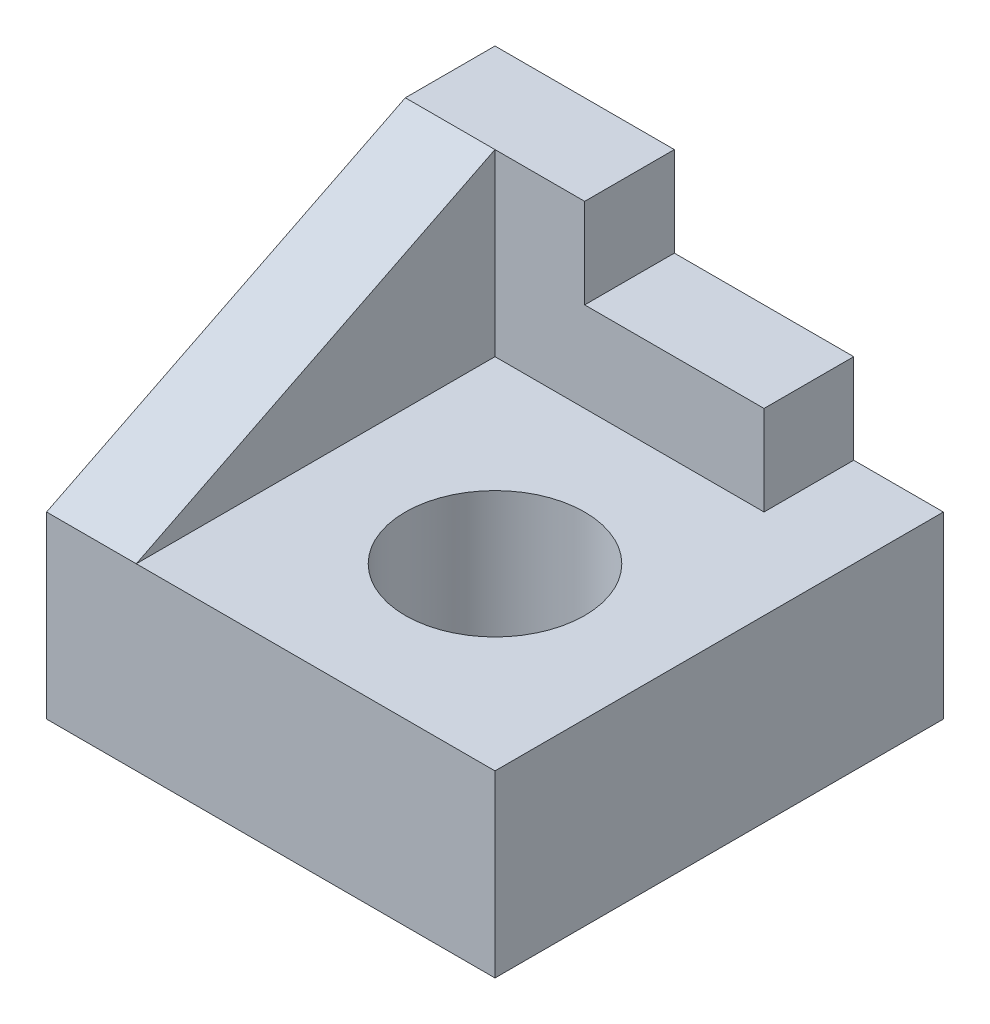
ISO-10303-21;
HEADER;
FILE_DESCRIPTION(('STEP AP214'),'2;1');
FILE_NAME('part.step','',(''),(''),'','','');
FILE_SCHEMA(('AUTOMOTIVE_DESIGN { 1 0 10303 214 1 1 1 1 }'));
ENDSEC;
DATA;
#1=APPLICATION_CONTEXT('core data for automotive mechanical design processes');
#2=APPLICATION_PROTOCOL_DEFINITION('international standard','automotive_design',2000,#1);
#3=PRODUCT_CONTEXT('',#1,'mechanical');
#4=PRODUCT('Part','Part','',(#3));
#5=PRODUCT_RELATED_PRODUCT_CATEGORY('part','',(#4));
#6=PRODUCT_DEFINITION_FORMATION('','',#4);
#7=PRODUCT_DEFINITION_CONTEXT('part definition',#1,'design');
#8=PRODUCT_DEFINITION('design','',#6,#7);
#9=PRODUCT_DEFINITION_SHAPE('','',#8);
#10=(LENGTH_UNIT() NAMED_UNIT(*) SI_UNIT(.MILLI.,.METRE.));
#11=(NAMED_UNIT(*) PLANE_ANGLE_UNIT() SI_UNIT($,.RADIAN.));
#12=(NAMED_UNIT(*) SI_UNIT($,.STERADIAN.) SOLID_ANGLE_UNIT());
#13=UNCERTAINTY_MEASURE_WITH_UNIT(LENGTH_MEASURE(1.E-05),#10,'distance_accuracy_value','');
#14=(GEOMETRIC_REPRESENTATION_CONTEXT(3) GLOBAL_UNCERTAINTY_ASSIGNED_CONTEXT((#13)) GLOBAL_UNIT_ASSIGNED_CONTEXT((#10,
#11,#12)) REPRESENTATION_CONTEXT('',''));
#15=CARTESIAN_POINT('',(0.,0.,0.));
#16=DIRECTION('',(0.,0.,1.));
#17=DIRECTION('',(1.,0.,0.));
#18=AXIS2_PLACEMENT_3D('',#15,#16,#17);
#19=CARTESIAN_POINT('',(-3.20197690394678,7.31554089852077,-1.1771553775596));
#20=DIRECTION('',(0.,0.,-1.));
#21=DIRECTION('',(-1.,0.,0.));
#22=AXIS2_PLACEMENT_3D('',#19,#20,#21);
#23=PLANE('',#22);
#24=DIRECTION('',(1.,0.,0.));
#25=VECTOR('',#24,1.);
#26=CARTESIAN_POINT('',(-3.20197690394678,7.31554089852077,-1.1771553775596));
#27=LINE('',#26,#25);
#28=CARTESIAN_POINT('',(-5.20197690394678,7.31554089852077,-1.1771553775596));
#29=VERTEX_POINT('',#28);
#30=CARTESIAN_POINT('',(-1.20197690394678,7.31554089852077,-1.1771553775596));
#31=VERTEX_POINT('',#30);
#32=EDGE_CURVE('E137',#29,#31,#27,.T.);
#33=ORIENTED_EDGE('',*,*,#32,.F.);
#34=DIRECTION('',(1.,0.,0.));
#35=VECTOR('',#34,1.);
#36=CARTESIAN_POINT('',(-9.20197690394678,7.31554089852077,-1.1771553775596));
#37=LINE('',#36,#35);
#38=CARTESIAN_POINT('',(-6.20197690394678,7.31554089852077,-1.1771553775596));
#39=VERTEX_POINT('',#38);
#40=EDGE_CURVE('E118',#39,#29,#37,.T.);
#41=ORIENTED_EDGE('',*,*,#40,.F.);
#42=DIRECTION('',(0.,-1.,0.));
#43=VECTOR('',#42,1.);
#44=CARTESIAN_POINT('',(-6.20197690394678,9.31554089852077,-1.1771553775596));
#45=LINE('',#44,#43);
#46=CARTESIAN_POINT('',(-6.20197690394678,5.31554089852077,-1.1771553775596));
#47=VERTEX_POINT('',#46);
#48=EDGE_CURVE('E193',#39,#47,#45,.T.);
#49=ORIENTED_EDGE('',*,*,#48,.T.);
#50=DIRECTION('',(1.,0.,0.));
#51=VECTOR('',#50,1.);
#52=CARTESIAN_POINT('',(-3.20197690394678,5.31554089852077,-1.1771553775596));
#53=LINE('',#52,#51);
#54=CARTESIAN_POINT('',(-1.20197690394678,5.31554089852077,-1.1771553775596));
#55=VERTEX_POINT('',#54);
#56=EDGE_CURVE('E157',#47,#55,#53,.T.);
#57=ORIENTED_EDGE('',*,*,#56,.T.);
#58=DIRECTION('',(0.,-1.,0.));
#59=VECTOR('',#58,1.);
#60=CARTESIAN_POINT('',(-1.20197690394678,7.31554089852077,-1.1771553775596));
#61=LINE('',#60,#59);
#62=EDGE_CURVE('E47',#31,#55,#61,.T.);
#63=ORIENTED_EDGE('',*,*,#62,.F.);
#64=EDGE_LOOP('',(#33,#41,#49,#57,#63));
#65=FACE_BOUND('',#64,.T.);
#66=ADVANCED_FACE('F38',(#65),#23,.F.);
#67=CARTESIAN_POINT('',(-1.20197690394678,7.31554089852077,-3.1771553775596));
#68=DIRECTION('',(1.,0.,0.));
#69=DIRECTION('',(0.,0.,-1.));
#70=AXIS2_PLACEMENT_3D('',#67,#68,#69);
#71=PLANE('',#70);
#72=DIRECTION('',(0.,0.,1.));
#73=VECTOR('',#72,1.);
#74=CARTESIAN_POINT('',(-1.20197690394678,5.31554089852077,-3.1771553775596));
#75=LINE('',#74,#73);
#76=CARTESIAN_POINT('',(-1.20197690394678,5.31554089852077,-6.1771553775596));
#77=VERTEX_POINT('',#76);
#78=EDGE_CURVE('E160',#77,#55,#75,.T.);
#79=ORIENTED_EDGE('',*,*,#78,.F.);
#80=DIRECTION('',(0.,-1.,0.));
#81=VECTOR('',#80,1.);
#82=CARTESIAN_POINT('',(-1.20197690394678,7.31554089852077,-6.1771553775596));
#83=LINE('',#82,#81);
#84=CARTESIAN_POINT('',(-1.20197690394678,7.31554089852077,-6.1771553775596));
#85=VERTEX_POINT('',#84);
#86=EDGE_CURVE('E55',#85,#77,#83,.T.);
#87=ORIENTED_EDGE('',*,*,#86,.F.);
#88=DIRECTION('',(0.,0.,1.));
#89=VECTOR('',#88,1.);
#90=CARTESIAN_POINT('',(-1.20197690394678,7.31554089852077,-3.1771553775596));
#91=LINE('',#90,#89);
#92=EDGE_CURVE('E139',#85,#31,#91,.T.);
#93=ORIENTED_EDGE('',*,*,#92,.T.);
#94=ORIENTED_EDGE('',*,*,#62,.T.);
#95=EDGE_LOOP('',(#79,#87,#93,#94));
#96=FACE_BOUND('',#95,.T.);
#97=ADVANCED_FACE('F171',(#96),#71,.T.);
#98=CARTESIAN_POINT('',(-3.20197690394678,7.31554089852077,-6.1771553775596));
#99=DIRECTION('',(0.,0.,-1.));
#100=DIRECTION('',(-1.,0.,0.));
#101=AXIS2_PLACEMENT_3D('',#98,#99,#100);
#102=PLANE('',#101);
#103=DIRECTION('',(1.,0.,0.));
#104=VECTOR('',#103,1.);
#105=CARTESIAN_POINT('',(-3.20197690394678,5.31554089852077,-6.1771553775596));
#106=LINE('',#105,#104);
#107=CARTESIAN_POINT('',(-6.20197690394678,5.31554089852077,-6.1771553775596));
#108=VERTEX_POINT('',#107);
#109=EDGE_CURVE('E163',#108,#77,#106,.T.);
#110=ORIENTED_EDGE('',*,*,#109,.F.);
#111=DIRECTION('',(0.,-1.,0.));
#112=VECTOR('',#111,1.);
#113=CARTESIAN_POINT('',(-6.20197690394678,9.31554089852077,-6.1771553775596));
#114=LINE('',#113,#112);
#115=CARTESIAN_POINT('',(-6.20197690394678,9.31554089852077,-6.1771553775596));
#116=VERTEX_POINT('',#115);
#117=EDGE_CURVE('E195',#116,#108,#114,.T.);
#118=ORIENTED_EDGE('',*,*,#117,.F.);
#119=DIRECTION('',(1.,0.,0.));
#120=VECTOR('',#119,1.);
#121=CARTESIAN_POINT('',(-3.20197690394678,9.31554089852077,-6.1771553775596));
#122=LINE('',#121,#120);
#123=CARTESIAN_POINT('',(-4.20197690394678,9.31554089852077,-6.1771553775596));
#124=VERTEX_POINT('',#123);
#125=EDGE_CURVE('E183',#116,#124,#122,.T.);
#126=ORIENTED_EDGE('',*,*,#125,.T.);
#127=DIRECTION('',(0.,-1.,0.));
#128=VECTOR('',#127,1.);
#129=CARTESIAN_POINT('',(-4.20197690394678,9.31554089852077,-6.1771553775596));
#130=LINE('',#129,#128);
#131=CARTESIAN_POINT('',(-4.20197690394678,8.31554089852077,-6.1771553775596));
#132=VERTEX_POINT('',#131);
#133=EDGE_CURVE('E197',#124,#132,#130,.T.);
#134=ORIENTED_EDGE('',*,*,#133,.T.);
#135=DIRECTION('',(1.,0.,0.));
#136=VECTOR('',#135,1.);
#137=CARTESIAN_POINT('',(-3.20197690394678,8.31554089852077,-6.1771553775596));
#138=LINE('',#137,#136);
#139=CARTESIAN_POINT('',(-2.20197690394678,8.31554089852077,-6.1771553775596));
#140=VERTEX_POINT('',#139);
#141=EDGE_CURVE('E205',#132,#140,#138,.T.);
#142=ORIENTED_EDGE('',*,*,#141,.T.);
#143=DIRECTION('',(0.,-1.,0.));
#144=VECTOR('',#143,1.);
#145=CARTESIAN_POINT('',(-2.20197690394678,8.31554089852077,-6.1771553775596));
#146=LINE('',#145,#144);
#147=CARTESIAN_POINT('',(-2.20197690394678,7.31554089852077,-6.1771553775596));
#148=VERTEX_POINT('',#147);
#149=EDGE_CURVE('E211',#140,#148,#146,.T.);
#150=ORIENTED_EDGE('',*,*,#149,.T.);
#151=DIRECTION('',(1.,0.,0.));
#152=VECTOR('',#151,1.);
#153=CARTESIAN_POINT('',(-3.20197690394678,7.31554089852077,-6.1771553775596));
#154=LINE('',#153,#152);
#155=EDGE_CURVE('E149',#148,#85,#154,.T.);
#156=ORIENTED_EDGE('',*,*,#155,.T.);
#157=ORIENTED_EDGE('',*,*,#86,.T.);
#158=EDGE_LOOP('',(#110,#118,#126,#134,#142,#150,#156,#157));
#159=FACE_BOUND('',#158,.T.);
#160=ADVANCED_FACE('F167',(#159),#102,.T.);
#161=CARTESIAN_POINT('',(-3.20197690394678,7.31554089852077,-3.1771553775596));
#162=DIRECTION('',(0.,-1.,0.));
#163=DIRECTION('',(0.,0.,-1.));
#164=AXIS2_PLACEMENT_3D('',#161,#162,#163);
#165=CYLINDRICAL_SURFACE('',#164,1.);
#166=CARTESIAN_POINT('',(-3.20197690394678,7.31554089852077,-3.1771553775596));
#167=DIRECTION('',(0.,1.,0.));
#168=DIRECTION('',(0.,0.,1.));
#169=AXIS2_PLACEMENT_3D('',#166,#167,#168);
#170=CIRCLE('',#169,1.);
#171=CARTESIAN_POINT('',(-3.20197690394678,7.31554089852077,-2.1771553775596));
#172=VERTEX_POINT('',#171);
#173=EDGE_CURVE('E144',#172,#172,#170,.T.);
#174=ORIENTED_EDGE('',*,*,#173,.T.);
#175=EDGE_LOOP('',(#174));
#176=FACE_BOUND('',#175,.T.);
#177=CARTESIAN_POINT('',(-3.20197690394678,5.31554089852077,-3.1771553775596));
#178=DIRECTION('',(0.,1.,0.));
#179=DIRECTION('',(0.,0.,1.));
#180=AXIS2_PLACEMENT_3D('',#177,#178,#179);
#181=CIRCLE('',#180,1.);
#182=CARTESIAN_POINT('',(-3.20197690394678,5.31554089852077,-2.1771553775596));
#183=VERTEX_POINT('',#182);
#184=EDGE_CURVE('E154',#183,#183,#181,.T.);
#185=ORIENTED_EDGE('',*,*,#184,.F.);
#186=EDGE_LOOP('',(#185));
#187=FACE_BOUND('',#186,.T.);
#188=ADVANCED_FACE('F40',(#176,#187),#165,.F.);
#189=CARTESIAN_POINT('',(-3.20197690394678,7.31554089852077,-3.1771553775596));
#190=DIRECTION('',(0.,1.,0.));
#191=DIRECTION('',(0.,0.,1.));
#192=AXIS2_PLACEMENT_3D('',#189,#190,#191);
#193=PLANE('',#192);
#194=ORIENTED_EDGE('',*,*,#173,.F.);
#195=EDGE_LOOP('',(#194));
#196=FACE_BOUND('',#195,.T.);
#197=DIRECTION('',(1.,0.,0.));
#198=VECTOR('',#197,1.);
#199=CARTESIAN_POINT('',(-3.20197690394678,7.31554089852077,-5.1771553775596));
#200=LINE('',#199,#198);
#201=CARTESIAN_POINT('',(-5.20197690394678,7.31554089852077,-5.1771553775596));
#202=VERTEX_POINT('',#201);
#203=CARTESIAN_POINT('',(-2.20197690394678,7.31554089852077,-5.1771553775596));
#204=VERTEX_POINT('',#203);
#205=EDGE_CURVE('E71',#202,#204,#200,.T.);
#206=ORIENTED_EDGE('',*,*,#205,.F.);
#207=DIRECTION('',(0.,0.,1.));
#208=VECTOR('',#207,1.);
#209=CARTESIAN_POINT('',(-5.20197690394678,7.31554089852077,-3.1771553775596));
#210=LINE('',#209,#208);
#211=EDGE_CURVE('E133',#202,#29,#210,.T.);
#212=ORIENTED_EDGE('',*,*,#211,.T.);
#213=ORIENTED_EDGE('',*,*,#32,.T.);
#214=ORIENTED_EDGE('',*,*,#92,.F.);
#215=ORIENTED_EDGE('',*,*,#155,.F.);
#216=DIRECTION('',(0.,0.,-1.));
#217=VECTOR('',#216,1.);
#218=CARTESIAN_POINT('',(-2.20197690394678,7.31554089852077,-3.1771553775596));
#219=LINE('',#218,#217);
#220=EDGE_CURVE('E152',#204,#148,#219,.T.);
#221=ORIENTED_EDGE('',*,*,#220,.F.);
#222=EDGE_LOOP('',(#206,#212,#213,#214,#215,#221));
#223=FACE_BOUND('',#222,.T.);
#224=ADVANCED_FACE('F141',(#196,#223),#193,.T.);
#225=CARTESIAN_POINT('',(-3.20197690394678,5.31554089852077,-3.1771553775596));
#226=DIRECTION('',(0.,1.,0.));
#227=DIRECTION('',(0.,0.,1.));
#228=AXIS2_PLACEMENT_3D('',#225,#226,#227);
#229=PLANE('',#228);
#230=ORIENTED_EDGE('',*,*,#56,.F.);
#231=DIRECTION('',(0.,0.,1.));
#232=VECTOR('',#231,1.);
#233=CARTESIAN_POINT('',(-6.20197690394678,5.31554089852077,-3.1771553775596));
#234=LINE('',#233,#232);
#235=EDGE_CURVE('E178',#108,#47,#234,.T.);
#236=ORIENTED_EDGE('',*,*,#235,.F.);
#237=ORIENTED_EDGE('',*,*,#109,.T.);
#238=ORIENTED_EDGE('',*,*,#78,.T.);
#239=EDGE_LOOP('',(#230,#236,#237,#238));
#240=FACE_BOUND('',#239,.T.);
#241=ORIENTED_EDGE('',*,*,#184,.T.);
#242=EDGE_LOOP('',(#241));
#243=FACE_BOUND('',#242,.T.);
#244=ADVANCED_FACE('F175',(#240,#243),#229,.F.);
#245=CARTESIAN_POINT('',(-3.20197690394678,8.31554089852077,-5.1771553775596));
#246=DIRECTION('',(0.,0.,-1.));
#247=DIRECTION('',(-1.,0.,0.));
#248=AXIS2_PLACEMENT_3D('',#245,#246,#247);
#249=PLANE('',#248);
#250=ORIENTED_EDGE('',*,*,#205,.T.);
#251=DIRECTION('',(0.,-1.,0.));
#252=VECTOR('',#251,1.);
#253=CARTESIAN_POINT('',(-2.20197690394678,8.31554089852077,-5.1771553775596));
#254=LINE('',#253,#252);
#255=CARTESIAN_POINT('',(-2.20197690394678,8.31554089852077,-5.1771553775596));
#256=VERTEX_POINT('',#255);
#257=EDGE_CURVE('E158',#256,#204,#254,.T.);
#258=ORIENTED_EDGE('',*,*,#257,.F.);
#259=DIRECTION('',(1.,0.,0.));
#260=VECTOR('',#259,1.);
#261=CARTESIAN_POINT('',(-3.20197690394678,8.31554089852077,-5.1771553775596));
#262=LINE('',#261,#260);
#263=CARTESIAN_POINT('',(-4.20197690394678,8.31554089852077,-5.1771553775596));
#264=VERTEX_POINT('',#263);
#265=EDGE_CURVE('E200',#264,#256,#262,.T.);
#266=ORIENTED_EDGE('',*,*,#265,.F.);
#267=DIRECTION('',(0.,-1.,0.));
#268=VECTOR('',#267,1.);
#269=CARTESIAN_POINT('',(-4.20197690394678,9.31554089852077,-5.1771553775596));
#270=LINE('',#269,#268);
#271=CARTESIAN_POINT('',(-4.20197690394678,9.31554089852077,-5.1771553775596));
#272=VERTEX_POINT('',#271);
#273=EDGE_CURVE('E190',#272,#264,#270,.T.);
#274=ORIENTED_EDGE('',*,*,#273,.F.);
#275=DIRECTION('',(1.,0.,0.));
#276=VECTOR('',#275,1.);
#277=CARTESIAN_POINT('',(-3.20197690394678,9.31554089852077,-5.1771553775596));
#278=LINE('',#277,#276);
#279=CARTESIAN_POINT('',(-5.20197690394678,9.31554089852077,-5.1771553775596));
#280=VERTEX_POINT('',#279);
#281=EDGE_CURVE('E188',#280,#272,#278,.T.);
#282=ORIENTED_EDGE('',*,*,#281,.F.);
#283=DIRECTION('',(0.,-1.,0.));
#284=VECTOR('',#283,1.);
#285=CARTESIAN_POINT('',(-5.20197690394678,9.31554089852077,-5.1771553775596));
#286=LINE('',#285,#284);
#287=EDGE_CURVE('E134',#280,#202,#286,.T.);
#288=ORIENTED_EDGE('',*,*,#287,.T.);
#289=EDGE_LOOP('',(#250,#258,#266,#274,#282,#288));
#290=FACE_BOUND('',#289,.T.);
#291=ADVANCED_FACE('F224',(#290),#249,.F.);
#292=CARTESIAN_POINT('',(-2.20197690394678,8.31554089852077,-3.1771553775596));
#293=DIRECTION('',(-1.,0.,0.));
#294=DIRECTION('',(0.,0.,1.));
#295=AXIS2_PLACEMENT_3D('',#292,#293,#294);
#296=PLANE('',#295);
#297=ORIENTED_EDGE('',*,*,#220,.T.);
#298=ORIENTED_EDGE('',*,*,#149,.F.);
#299=DIRECTION('',(0.,0.,-1.));
#300=VECTOR('',#299,1.);
#301=CARTESIAN_POINT('',(-2.20197690394678,8.31554089852077,-3.1771553775596));
#302=LINE('',#301,#300);
#303=EDGE_CURVE('E203',#256,#140,#302,.T.);
#304=ORIENTED_EDGE('',*,*,#303,.F.);
#305=ORIENTED_EDGE('',*,*,#257,.T.);
#306=EDGE_LOOP('',(#297,#298,#304,#305));
#307=FACE_BOUND('',#306,.T.);
#308=ADVANCED_FACE('F265',(#307),#296,.F.);
#309=CARTESIAN_POINT('',(-3.20197690394678,8.31554089852077,-3.1771553775596));
#310=DIRECTION('',(0.,1.,0.));
#311=DIRECTION('',(0.,0.,1.));
#312=AXIS2_PLACEMENT_3D('',#309,#310,#311);
#313=PLANE('',#312);
#314=ORIENTED_EDGE('',*,*,#265,.T.);
#315=ORIENTED_EDGE('',*,*,#303,.T.);
#316=ORIENTED_EDGE('',*,*,#141,.F.);
#317=DIRECTION('',(0.,0.,1.));
#318=VECTOR('',#317,1.);
#319=CARTESIAN_POINT('',(-4.20197690394678,8.31554089852077,-3.1771553775596));
#320=LINE('',#319,#318);
#321=EDGE_CURVE('E208',#132,#264,#320,.T.);
#322=ORIENTED_EDGE('',*,*,#321,.T.);
#323=EDGE_LOOP('',(#314,#315,#316,#322));
#324=FACE_BOUND('',#323,.T.);
#325=ADVANCED_FACE('F274',(#324),#313,.T.);
#326=CARTESIAN_POINT('',(-4.20197690394678,9.31554089852077,-3.1771553775596));
#327=DIRECTION('',(1.,0.,0.));
#328=DIRECTION('',(0.,0.,-1.));
#329=AXIS2_PLACEMENT_3D('',#326,#327,#328);
#330=PLANE('',#329);
#331=ORIENTED_EDGE('',*,*,#273,.T.);
#332=ORIENTED_EDGE('',*,*,#321,.F.);
#333=ORIENTED_EDGE('',*,*,#133,.F.);
#334=DIRECTION('',(0.,0.,1.));
#335=VECTOR('',#334,1.);
#336=CARTESIAN_POINT('',(-4.20197690394678,9.31554089852077,-3.1771553775596));
#337=LINE('',#336,#335);
#338=EDGE_CURVE('E180',#124,#272,#337,.T.);
#339=ORIENTED_EDGE('',*,*,#338,.T.);
#340=EDGE_LOOP('',(#331,#332,#333,#339));
#341=FACE_BOUND('',#340,.T.);
#342=ADVANCED_FACE('F285',(#341),#330,.T.);
#343=CARTESIAN_POINT('',(-6.20197690394678,9.31554089852077,-3.1771553775596));
#344=DIRECTION('',(1.,0.,0.));
#345=DIRECTION('',(0.,0.,-1.));
#346=AXIS2_PLACEMENT_3D('',#343,#344,#345);
#347=PLANE('',#346);
#348=ORIENTED_EDGE('',*,*,#48,.F.);
#349=DIRECTION('',(0.,0.447213595499958,-0.894427190999916));
#350=VECTOR('',#349,1.);
#351=CARTESIAN_POINT('',(-6.20197690394678,8.51554089852077,-3.5771553775596));
#352=LINE('',#351,#350);
#353=CARTESIAN_POINT('',(-6.20197690394678,9.31554089852077,-5.1771553775596));
#354=VERTEX_POINT('',#353);
#355=EDGE_CURVE('E124',#39,#354,#352,.T.);
#356=ORIENTED_EDGE('',*,*,#355,.T.);
#357=DIRECTION('',(0.,0.,1.));
#358=VECTOR('',#357,1.);
#359=CARTESIAN_POINT('',(-6.20197690394678,9.31554089852077,-3.1771553775596));
#360=LINE('',#359,#358);
#361=EDGE_CURVE('E345',#116,#354,#360,.T.);
#362=ORIENTED_EDGE('',*,*,#361,.F.);
#363=ORIENTED_EDGE('',*,*,#117,.T.);
#364=ORIENTED_EDGE('',*,*,#235,.T.);
#365=EDGE_LOOP('',(#348,#356,#362,#363,#364));
#366=FACE_BOUND('',#365,.T.);
#367=ADVANCED_FACE('F296',(#366),#347,.F.);
#368=CARTESIAN_POINT('',(-5.20197690394678,9.31554089852077,-3.1771553775596));
#369=DIRECTION('',(1.,0.,0.));
#370=DIRECTION('',(0.,0.,-1.));
#371=AXIS2_PLACEMENT_3D('',#368,#369,#370);
#372=PLANE('',#371);
#373=DIRECTION('',(0.,0.447213595499958,-0.894427190999916));
#374=VECTOR('',#373,1.);
#375=CARTESIAN_POINT('',(-5.20197690394678,7.31554089852077,-1.1771553775596));
#376=LINE('',#375,#374);
#377=EDGE_CURVE('E121',#29,#280,#376,.T.);
#378=ORIENTED_EDGE('',*,*,#377,.F.);
#379=ORIENTED_EDGE('',*,*,#211,.F.);
#380=ORIENTED_EDGE('',*,*,#287,.F.);
#381=EDGE_LOOP('',(#378,#379,#380));
#382=FACE_BOUND('',#381,.T.);
#383=ADVANCED_FACE('F131',(#382),#372,.T.);
#384=CARTESIAN_POINT('',(-3.20197690394678,9.31554089852077,-3.1771553775596));
#385=DIRECTION('',(0.,1.,0.));
#386=DIRECTION('',(0.,0.,1.));
#387=AXIS2_PLACEMENT_3D('',#384,#385,#386);
#388=PLANE('',#387);
#389=DIRECTION('',(-1.,0.,0.));
#390=VECTOR('',#389,1.);
#391=CARTESIAN_POINT('',(-3.20197690394678,9.31554089852077,-5.1771553775596));
#392=LINE('',#391,#390);
#393=EDGE_CURVE('E11',#280,#354,#392,.T.);
#394=ORIENTED_EDGE('',*,*,#393,.F.);
#395=ORIENTED_EDGE('',*,*,#281,.T.);
#396=ORIENTED_EDGE('',*,*,#338,.F.);
#397=ORIENTED_EDGE('',*,*,#125,.F.);
#398=ORIENTED_EDGE('',*,*,#361,.T.);
#399=EDGE_LOOP('',(#394,#395,#396,#397,#398));
#400=FACE_BOUND('',#399,.T.);
#401=ADVANCED_FACE('F316',(#400),#388,.T.);
#402=CARTESIAN_POINT('',(-9.20197690394678,7.31554089852077,-1.1771553775596));
#403=DIRECTION('',(0.,-0.894427190999916,-0.447213595499958));
#404=DIRECTION('',(0.,0.447213595499958,-0.894427190999916));
#405=AXIS2_PLACEMENT_3D('',#402,#403,#404);
#406=PLANE('',#405);
#407=ORIENTED_EDGE('',*,*,#40,.T.);
#408=ORIENTED_EDGE('',*,*,#377,.T.);
#409=ORIENTED_EDGE('',*,*,#393,.T.);
#410=ORIENTED_EDGE('',*,*,#355,.F.);
#411=EDGE_LOOP('',(#407,#408,#409,#410));
#412=FACE_BOUND('',#411,.T.);
#413=ADVANCED_FACE('F120',(#412),#406,.F.);
#414=CLOSED_SHELL('',(#66,#97,#160,#188,#224,#244,#291,#308,#325,#342,#367,#383,#401,#413));
#415=MANIFOLD_SOLID_BREP('B2',#414);
#416=ADVANCED_BREP_SHAPE_REPRESENTATION('',(#18,#415),#14);
#417=SHAPE_DEFINITION_REPRESENTATION(#9,#416);
ENDSEC;
END-ISO-10303-21;
